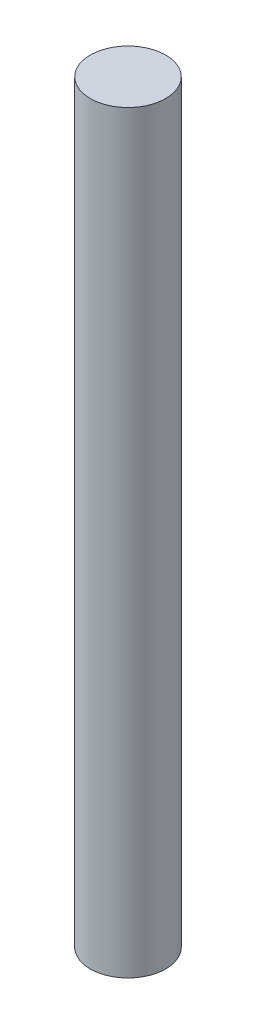
ISO-10303-21;
HEADER;
FILE_DESCRIPTION(('STEP AP214'),'2;1');
FILE_NAME('part.step','',(''),(''),'','','');
FILE_SCHEMA(('AUTOMOTIVE_DESIGN { 1 0 10303 214 1 1 1 1 }'));
ENDSEC;
DATA;
#1=APPLICATION_CONTEXT('core data for automotive mechanical design processes');
#2=APPLICATION_PROTOCOL_DEFINITION('international standard','automotive_design',2000,#1);
#3=PRODUCT_CONTEXT('',#1,'mechanical');
#4=PRODUCT('Part','Part','',(#3));
#5=PRODUCT_RELATED_PRODUCT_CATEGORY('part','',(#4));
#6=PRODUCT_DEFINITION_FORMATION('','',#4);
#7=PRODUCT_DEFINITION_CONTEXT('part definition',#1,'design');
#8=PRODUCT_DEFINITION('design','',#6,#7);
#9=PRODUCT_DEFINITION_SHAPE('','',#8);
#10=(LENGTH_UNIT() NAMED_UNIT(*) SI_UNIT(.MILLI.,.METRE.));
#11=(NAMED_UNIT(*) PLANE_ANGLE_UNIT() SI_UNIT($,.RADIAN.));
#12=(NAMED_UNIT(*) SI_UNIT($,.STERADIAN.) SOLID_ANGLE_UNIT());
#13=UNCERTAINTY_MEASURE_WITH_UNIT(LENGTH_MEASURE(1.E-05),#10,'distance_accuracy_value','');
#14=(GEOMETRIC_REPRESENTATION_CONTEXT(3) GLOBAL_UNCERTAINTY_ASSIGNED_CONTEXT((#13)) GLOBAL_UNIT_ASSIGNED_CONTEXT((#10,
#11,#12)) REPRESENTATION_CONTEXT('',''));
#15=CARTESIAN_POINT('',(0.,0.,0.));
#16=DIRECTION('',(0.,0.,1.));
#17=DIRECTION('',(1.,0.,0.));
#18=AXIS2_PLACEMENT_3D('',#15,#16,#17);
#19=CARTESIAN_POINT('',(0.,75.,0.));
#20=DIRECTION('',(0.,-1.,0.));
#21=DIRECTION('',(0.,0.,-1.));
#22=AXIS2_PLACEMENT_3D('',#19,#20,#21);
#23=CYLINDRICAL_SURFACE('',#22,7.5);
#24=CARTESIAN_POINT('',(0.,75.,0.));
#25=DIRECTION('',(0.,1.,0.));
#26=DIRECTION('',(0.,0.,1.));
#27=AXIS2_PLACEMENT_3D('',#24,#25,#26);
#28=CIRCLE('',#27,7.5);
#29=CARTESIAN_POINT('',(0.,75.,7.5));
#30=VERTEX_POINT('',#29);
#31=EDGE_CURVE('E10',#30,#30,#28,.T.);
#32=ORIENTED_EDGE('',*,*,#31,.F.);
#33=EDGE_LOOP('',(#32));
#34=FACE_BOUND('',#33,.T.);
#35=CARTESIAN_POINT('',(0.,-75.,0.));
#36=DIRECTION('',(0.,1.,0.));
#37=DIRECTION('',(0.,0.,1.));
#38=AXIS2_PLACEMENT_3D('',#35,#36,#37);
#39=CIRCLE('',#38,7.5);
#40=CARTESIAN_POINT('',(0.,-75.,7.5));
#41=VERTEX_POINT('',#40);
#42=EDGE_CURVE('E42',#41,#41,#39,.T.);
#43=ORIENTED_EDGE('',*,*,#42,.T.);
#44=EDGE_LOOP('',(#43));
#45=FACE_BOUND('',#44,.T.);
#46=ADVANCED_FACE('F39',(#34,#45),#23,.T.);
#47=CARTESIAN_POINT('',(0.,75.,0.));
#48=DIRECTION('',(0.,1.,0.));
#49=DIRECTION('',(0.,0.,1.));
#50=AXIS2_PLACEMENT_3D('',#47,#48,#49);
#51=PLANE('',#50);
#52=ORIENTED_EDGE('',*,*,#31,.T.);
#53=EDGE_LOOP('',(#52));
#54=FACE_BOUND('',#53,.T.);
#55=ADVANCED_FACE('F54',(#54),#51,.T.);
#56=CARTESIAN_POINT('',(0.,-75.,0.));
#57=DIRECTION('',(0.,1.,0.));
#58=DIRECTION('',(0.,0.,1.));
#59=AXIS2_PLACEMENT_3D('',#56,#57,#58);
#60=PLANE('',#59);
#61=ORIENTED_EDGE('',*,*,#42,.F.);
#62=EDGE_LOOP('',(#61));
#63=FACE_BOUND('',#62,.T.);
#64=ADVANCED_FACE('F52',(#63),#60,.F.);
#65=CLOSED_SHELL('',(#46,#55,#64));
#66=MANIFOLD_SOLID_BREP('B2',#65);
#67=ADVANCED_BREP_SHAPE_REPRESENTATION('',(#18,#66),#14);
#68=SHAPE_DEFINITION_REPRESENTATION(#9,#67);
ENDSEC;
END-ISO-10303-21;
